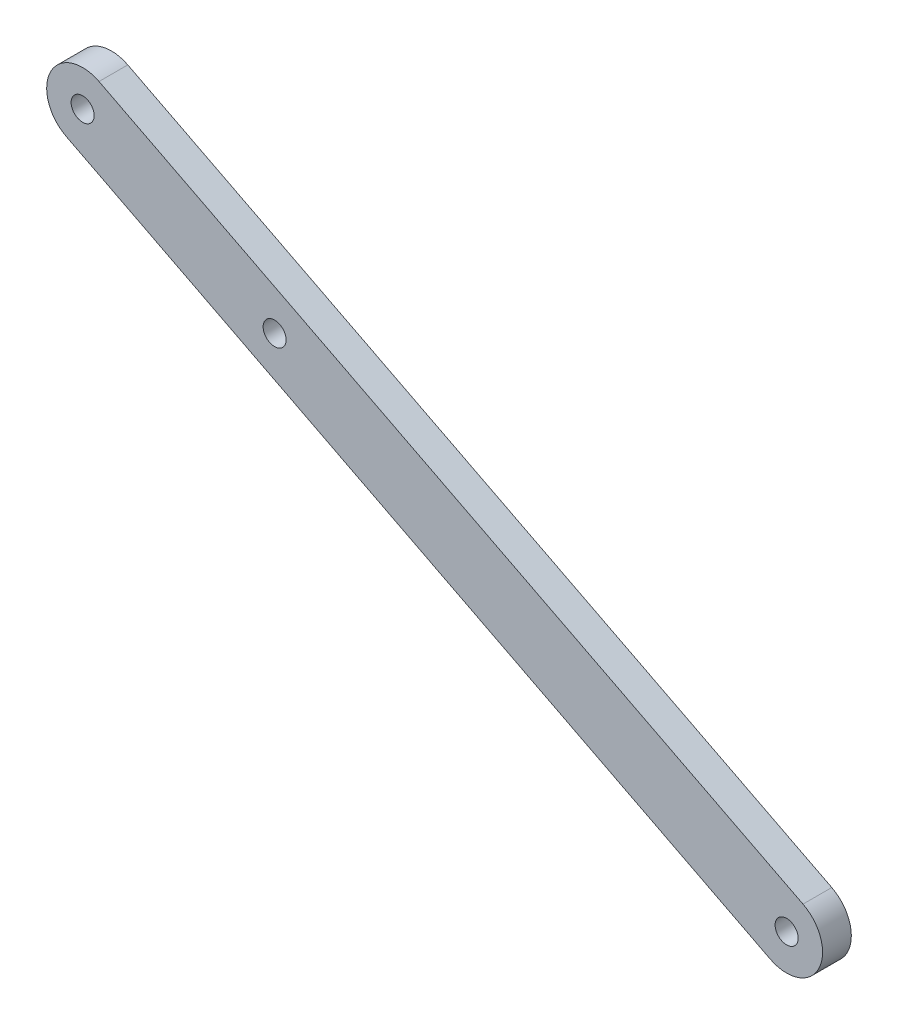
ISO-10303-21;
HEADER;
FILE_DESCRIPTION(('STEP AP214'),'2;1');
FILE_NAME('part.step','',(''),(''),'','','');
FILE_SCHEMA(('AUTOMOTIVE_DESIGN { 1 0 10303 214 1 1 1 1 }'));
ENDSEC;
DATA;
#1=APPLICATION_CONTEXT('core data for automotive mechanical design processes');
#2=APPLICATION_PROTOCOL_DEFINITION('international standard','automotive_design',2000,#1);
#3=PRODUCT_CONTEXT('',#1,'mechanical');
#4=PRODUCT('Part','Part','',(#3));
#5=PRODUCT_RELATED_PRODUCT_CATEGORY('part','',(#4));
#6=PRODUCT_DEFINITION_FORMATION('','',#4);
#7=PRODUCT_DEFINITION_CONTEXT('part definition',#1,'design');
#8=PRODUCT_DEFINITION('design','',#6,#7);
#9=PRODUCT_DEFINITION_SHAPE('','',#8);
#10=(LENGTH_UNIT() NAMED_UNIT(*) SI_UNIT(.MILLI.,.METRE.));
#11=(NAMED_UNIT(*) PLANE_ANGLE_UNIT() SI_UNIT($,.RADIAN.));
#12=(NAMED_UNIT(*) SI_UNIT($,.STERADIAN.) SOLID_ANGLE_UNIT());
#13=UNCERTAINTY_MEASURE_WITH_UNIT(LENGTH_MEASURE(1.E-05),#10,'distance_accuracy_value','');
#14=(GEOMETRIC_REPRESENTATION_CONTEXT(3) GLOBAL_UNCERTAINTY_ASSIGNED_CONTEXT((#13)) GLOBAL_UNIT_ASSIGNED_CONTEXT((#10,
#11,#12)) REPRESENTATION_CONTEXT('',''));
#15=CARTESIAN_POINT('',(0.,0.,0.));
#16=DIRECTION('',(0.,0.,1.));
#17=DIRECTION('',(1.,0.,0.));
#18=AXIS2_PLACEMENT_3D('',#15,#16,#17);
#19=CARTESIAN_POINT('',(0.,0.,4.));
#20=DIRECTION('',(0.,0.,1.));
#21=DIRECTION('',(1.,0.,0.));
#22=AXIS2_PLACEMENT_3D('',#19,#20,#21);
#23=PLANE('',#22);
#24=CARTESIAN_POINT('',(0.,0.,4.));
#25=DIRECTION('',(0.,0.,1.));
#26=DIRECTION('',(1.,0.,0.));
#27=AXIS2_PLACEMENT_3D('',#24,#25,#26);
#28=CIRCLE('',#27,1.6);
#29=CARTESIAN_POINT('',(1.60000000000001,0.,4.));
#30=VERTEX_POINT('',#29);
#31=EDGE_CURVE('E117',#30,#30,#28,.T.);
#32=ORIENTED_EDGE('',*,*,#31,.F.);
#33=EDGE_LOOP('',(#32));
#34=FACE_BOUND('',#33,.T.);
#35=CARTESIAN_POINT('',(0.,0.,4.));
#36=DIRECTION('',(0.,0.,1.));
#37=DIRECTION('',(1.,0.,0.));
#38=AXIS2_PLACEMENT_3D('',#35,#36,#37);
#39=CIRCLE('',#38,5.);
#40=CARTESIAN_POINT('',(-2.27846198612919,-4.45068657375064,4.));
#41=VERTEX_POINT('',#40);
#42=CARTESIAN_POINT('',(2.2784619861292,4.45068657375064,4.));
#43=VERTEX_POINT('',#42);
#44=EDGE_CURVE('E87',#41,#43,#39,.T.);
#45=ORIENTED_EDGE('',*,*,#44,.T.);
#46=DIRECTION('',(-0.890137314750128,0.455692397225839,0.));
#47=VECTOR('',#46,1.);
#48=CARTESIAN_POINT('',(2.2784619861292,4.45068657375064,4.));
#49=LINE('',#48,#47);
#50=CARTESIAN_POINT('',(-95.6366426363849,54.5768502685929,4.));
#51=VERTEX_POINT('',#50);
#52=EDGE_CURVE('E82',#43,#51,#49,.T.);
#53=ORIENTED_EDGE('',*,*,#52,.T.);
#54=CARTESIAN_POINT('',(-97.9151046225141,50.1261636948423,4.));
#55=DIRECTION('',(0.,0.,1.));
#56=DIRECTION('',(1.,0.,0.));
#57=AXIS2_PLACEMENT_3D('',#54,#55,#56);
#58=CIRCLE('',#57,5.);
#59=CARTESIAN_POINT('',(-100.193566608643,45.6754771210916,4.));
#60=VERTEX_POINT('',#59);
#61=EDGE_CURVE('E85',#51,#60,#58,.T.);
#62=ORIENTED_EDGE('',*,*,#61,.T.);
#63=DIRECTION('',(0.890137314750128,-0.455692397225839,0.));
#64=VECTOR('',#63,1.);
#65=CARTESIAN_POINT('',(-2.27846198612919,-4.45068657375064,4.));
#66=LINE('',#65,#64);
#67=EDGE_CURVE('E52',#60,#41,#66,.T.);
#68=ORIENTED_EDGE('',*,*,#67,.T.);
#69=EDGE_LOOP('',(#45,#53,#62,#68));
#70=FACE_BOUND('',#69,.T.);
#71=CARTESIAN_POINT('',(-97.9151046225141,50.1261636948423,4.));
#72=DIRECTION('',(0.,0.,1.));
#73=DIRECTION('',(1.,0.,0.));
#74=AXIS2_PLACEMENT_3D('',#71,#72,#73);
#75=CIRCLE('',#74,1.60000000000001);
#76=CARTESIAN_POINT('',(-96.3151046225141,50.1261636948423,4.));
#77=VERTEX_POINT('',#76);
#78=EDGE_CURVE('E102',#77,#77,#75,.T.);
#79=ORIENTED_EDGE('',*,*,#78,.F.);
#80=EDGE_LOOP('',(#79));
#81=FACE_BOUND('',#80,.T.);
#82=CARTESIAN_POINT('',(-71.2109851800102,36.4553917780671,4.));
#83=DIRECTION('',(0.,0.,1.));
#84=DIRECTION('',(1.,0.,0.));
#85=AXIS2_PLACEMENT_3D('',#82,#83,#84);
#86=CIRCLE('',#85,1.60000000000001);
#87=CARTESIAN_POINT('',(-69.6109851800102,36.4553917780671,4.));
#88=VERTEX_POINT('',#87);
#89=EDGE_CURVE('E123',#88,#88,#86,.T.);
#90=ORIENTED_EDGE('',*,*,#89,.F.);
#91=EDGE_LOOP('',(#90));
#92=FACE_BOUND('',#91,.T.);
#93=ADVANCED_FACE('F35',(#34,#70,#81,#92),#23,.T.);
#94=CARTESIAN_POINT('',(0.,0.,0.));
#95=DIRECTION('',(0.,0.,1.));
#96=DIRECTION('',(1.,0.,0.));
#97=AXIS2_PLACEMENT_3D('',#94,#95,#96);
#98=PLANE('',#97);
#99=CARTESIAN_POINT('',(0.,0.,0.));
#100=DIRECTION('',(0.,0.,1.));
#101=DIRECTION('',(1.,0.,0.));
#102=AXIS2_PLACEMENT_3D('',#99,#100,#101);
#103=CIRCLE('',#102,5.);
#104=CARTESIAN_POINT('',(-2.27846198612919,-4.45068657375064,0.));
#105=VERTEX_POINT('',#104);
#106=CARTESIAN_POINT('',(2.2784619861292,4.45068657375064,0.));
#107=VERTEX_POINT('',#106);
#108=EDGE_CURVE('E99',#105,#107,#103,.T.);
#109=ORIENTED_EDGE('',*,*,#108,.F.);
#110=DIRECTION('',(0.890137314750128,-0.455692397225839,0.));
#111=VECTOR('',#110,1.);
#112=CARTESIAN_POINT('',(-2.27846198612919,-4.45068657375064,0.));
#113=LINE('',#112,#111);
#114=CARTESIAN_POINT('',(-100.193566608643,45.6754771210916,0.));
#115=VERTEX_POINT('',#114);
#116=EDGE_CURVE('E75',#115,#105,#113,.T.);
#117=ORIENTED_EDGE('',*,*,#116,.F.);
#118=CARTESIAN_POINT('',(-97.9151046225141,50.1261636948423,0.));
#119=DIRECTION('',(0.,0.,1.));
#120=DIRECTION('',(1.,0.,0.));
#121=AXIS2_PLACEMENT_3D('',#118,#119,#120);
#122=CIRCLE('',#121,5.);
#123=CARTESIAN_POINT('',(-95.6366426363849,54.5768502685929,0.));
#124=VERTEX_POINT('',#123);
#125=EDGE_CURVE('E69',#124,#115,#122,.T.);
#126=ORIENTED_EDGE('',*,*,#125,.F.);
#127=DIRECTION('',(-0.890137314750128,0.455692397225839,0.));
#128=VECTOR('',#127,1.);
#129=CARTESIAN_POINT('',(2.2784619861292,4.45068657375064,0.));
#130=LINE('',#129,#128);
#131=EDGE_CURVE('E91',#107,#124,#130,.T.);
#132=ORIENTED_EDGE('',*,*,#131,.F.);
#133=EDGE_LOOP('',(#109,#117,#126,#132));
#134=FACE_BOUND('',#133,.T.);
#135=CARTESIAN_POINT('',(-97.9151046225141,50.1261636948423,0.));
#136=DIRECTION('',(0.,0.,1.));
#137=DIRECTION('',(1.,0.,0.));
#138=AXIS2_PLACEMENT_3D('',#135,#136,#137);
#139=CIRCLE('',#138,1.60000000000001);
#140=CARTESIAN_POINT('',(-96.3151046225141,50.1261636948423,0.));
#141=VERTEX_POINT('',#140);
#142=EDGE_CURVE('E114',#141,#141,#139,.T.);
#143=ORIENTED_EDGE('',*,*,#142,.T.);
#144=EDGE_LOOP('',(#143));
#145=FACE_BOUND('',#144,.T.);
#146=CARTESIAN_POINT('',(0.,0.,0.));
#147=DIRECTION('',(0.,0.,1.));
#148=DIRECTION('',(1.,0.,0.));
#149=AXIS2_PLACEMENT_3D('',#146,#147,#148);
#150=CIRCLE('',#149,1.6);
#151=CARTESIAN_POINT('',(1.60000000000001,0.,0.));
#152=VERTEX_POINT('',#151);
#153=EDGE_CURVE('E120',#152,#152,#150,.T.);
#154=ORIENTED_EDGE('',*,*,#153,.T.);
#155=EDGE_LOOP('',(#154));
#156=FACE_BOUND('',#155,.T.);
#157=CARTESIAN_POINT('',(-71.2109851800102,36.4553917780671,0.));
#158=DIRECTION('',(0.,0.,1.));
#159=DIRECTION('',(1.,0.,0.));
#160=AXIS2_PLACEMENT_3D('',#157,#158,#159);
#161=CIRCLE('',#160,1.60000000000001);
#162=CARTESIAN_POINT('',(-69.6109851800102,36.4553917780671,0.));
#163=VERTEX_POINT('',#162);
#164=EDGE_CURVE('E126',#163,#163,#161,.T.);
#165=ORIENTED_EDGE('',*,*,#164,.T.);
#166=EDGE_LOOP('',(#165));
#167=FACE_BOUND('',#166,.T.);
#168=ADVANCED_FACE('F110',(#134,#145,#156,#167),#98,.F.);
#169=CARTESIAN_POINT('',(0.,0.,4.));
#170=DIRECTION('',(0.,0.,-1.));
#171=DIRECTION('',(-1.,0.,0.));
#172=AXIS2_PLACEMENT_3D('',#169,#170,#171);
#173=CYLINDRICAL_SURFACE('',#172,5.);
#174=ORIENTED_EDGE('',*,*,#108,.T.);
#175=DIRECTION('',(0.,0.,-1.));
#176=VECTOR('',#175,1.);
#177=CARTESIAN_POINT('',(2.2784619861292,4.45068657375064,4.));
#178=LINE('',#177,#176);
#179=EDGE_CURVE('E11',#43,#107,#178,.T.);
#180=ORIENTED_EDGE('',*,*,#179,.F.);
#181=ORIENTED_EDGE('',*,*,#44,.F.);
#182=DIRECTION('',(0.,0.,-1.));
#183=VECTOR('',#182,1.);
#184=CARTESIAN_POINT('',(-2.27846198612919,-4.45068657375064,4.));
#185=LINE('',#184,#183);
#186=EDGE_CURVE('E95',#41,#105,#185,.T.);
#187=ORIENTED_EDGE('',*,*,#186,.T.);
#188=EDGE_LOOP('',(#174,#180,#181,#187));
#189=FACE_BOUND('',#188,.T.);
#190=ADVANCED_FACE('F37',(#189),#173,.T.);
#191=CARTESIAN_POINT('',(2.2784619861292,4.45068657375064,4.));
#192=DIRECTION('',(-0.455692397225839,-0.890137314750128,0.));
#193=DIRECTION('',(0.890137314750128,-0.455692397225839,0.));
#194=AXIS2_PLACEMENT_3D('',#191,#192,#193);
#195=PLANE('',#194);
#196=ORIENTED_EDGE('',*,*,#131,.T.);
#197=DIRECTION('',(0.,0.,-1.));
#198=VECTOR('',#197,1.);
#199=CARTESIAN_POINT('',(-95.6366426363849,54.5768502685929,4.));
#200=LINE('',#199,#198);
#201=EDGE_CURVE('E44',#51,#124,#200,.T.);
#202=ORIENTED_EDGE('',*,*,#201,.F.);
#203=ORIENTED_EDGE('',*,*,#52,.F.);
#204=ORIENTED_EDGE('',*,*,#179,.T.);
#205=EDGE_LOOP('',(#196,#202,#203,#204));
#206=FACE_BOUND('',#205,.T.);
#207=ADVANCED_FACE('F90',(#206),#195,.F.);
#208=CARTESIAN_POINT('',(-97.9151046225141,50.1261636948423,4.));
#209=DIRECTION('',(0.,0.,-1.));
#210=DIRECTION('',(-1.,0.,0.));
#211=AXIS2_PLACEMENT_3D('',#208,#209,#210);
#212=CYLINDRICAL_SURFACE('',#211,5.);
#213=ORIENTED_EDGE('',*,*,#125,.T.);
#214=DIRECTION('',(0.,0.,-1.));
#215=VECTOR('',#214,1.);
#216=CARTESIAN_POINT('',(-100.193566608643,45.6754771210916,4.));
#217=LINE('',#216,#215);
#218=EDGE_CURVE('E92',#60,#115,#217,.T.);
#219=ORIENTED_EDGE('',*,*,#218,.F.);
#220=ORIENTED_EDGE('',*,*,#61,.F.);
#221=ORIENTED_EDGE('',*,*,#201,.T.);
#222=EDGE_LOOP('',(#213,#219,#220,#221));
#223=FACE_BOUND('',#222,.T.);
#224=ADVANCED_FACE('F93',(#223),#212,.T.);
#225=CARTESIAN_POINT('',(-2.27846198612919,-4.45068657375064,4.));
#226=DIRECTION('',(0.455692397225839,0.890137314750128,0.));
#227=DIRECTION('',(-0.890137314750128,0.455692397225839,0.));
#228=AXIS2_PLACEMENT_3D('',#225,#226,#227);
#229=PLANE('',#228);
#230=ORIENTED_EDGE('',*,*,#116,.T.);
#231=ORIENTED_EDGE('',*,*,#186,.F.);
#232=ORIENTED_EDGE('',*,*,#67,.F.);
#233=ORIENTED_EDGE('',*,*,#218,.T.);
#234=EDGE_LOOP('',(#230,#231,#232,#233));
#235=FACE_BOUND('',#234,.T.);
#236=ADVANCED_FACE('F107',(#235),#229,.F.);
#237=CARTESIAN_POINT('',(-97.9151046225141,50.1261636948423,4.));
#238=DIRECTION('',(0.,0.,-1.));
#239=DIRECTION('',(-1.,0.,0.));
#240=AXIS2_PLACEMENT_3D('',#237,#238,#239);
#241=CYLINDRICAL_SURFACE('',#240,1.60000000000001);
#242=ORIENTED_EDGE('',*,*,#78,.T.);
#243=EDGE_LOOP('',(#242));
#244=FACE_BOUND('',#243,.T.);
#245=ORIENTED_EDGE('',*,*,#142,.F.);
#246=EDGE_LOOP('',(#245));
#247=FACE_BOUND('',#246,.T.);
#248=ADVANCED_FACE('F144',(#244,#247),#241,.F.);
#249=CARTESIAN_POINT('',(0.,0.,4.));
#250=DIRECTION('',(0.,0.,-1.));
#251=DIRECTION('',(-1.,0.,0.));
#252=AXIS2_PLACEMENT_3D('',#249,#250,#251);
#253=CYLINDRICAL_SURFACE('',#252,1.6);
#254=ORIENTED_EDGE('',*,*,#31,.T.);
#255=EDGE_LOOP('',(#254));
#256=FACE_BOUND('',#255,.T.);
#257=ORIENTED_EDGE('',*,*,#153,.F.);
#258=EDGE_LOOP('',(#257));
#259=FACE_BOUND('',#258,.T.);
#260=ADVANCED_FACE('F190',(#256,#259),#253,.F.);
#261=CARTESIAN_POINT('',(-71.2109851800102,36.4553917780671,4.));
#262=DIRECTION('',(0.,0.,-1.));
#263=DIRECTION('',(-1.,0.,0.));
#264=AXIS2_PLACEMENT_3D('',#261,#262,#263);
#265=CYLINDRICAL_SURFACE('',#264,1.60000000000001);
#266=ORIENTED_EDGE('',*,*,#89,.T.);
#267=EDGE_LOOP('',(#266));
#268=FACE_BOUND('',#267,.T.);
#269=ORIENTED_EDGE('',*,*,#164,.F.);
#270=EDGE_LOOP('',(#269));
#271=FACE_BOUND('',#270,.T.);
#272=ADVANCED_FACE('F132',(#268,#271),#265,.F.);
#273=CLOSED_SHELL('',(#93,#168,#190,#207,#224,#236,#248,#260,#272));
#274=MANIFOLD_SOLID_BREP('B2',#273);
#275=ADVANCED_BREP_SHAPE_REPRESENTATION('',(#18,#274),#14);
#276=SHAPE_DEFINITION_REPRESENTATION(#9,#275);
ENDSEC;
END-ISO-10303-21;
